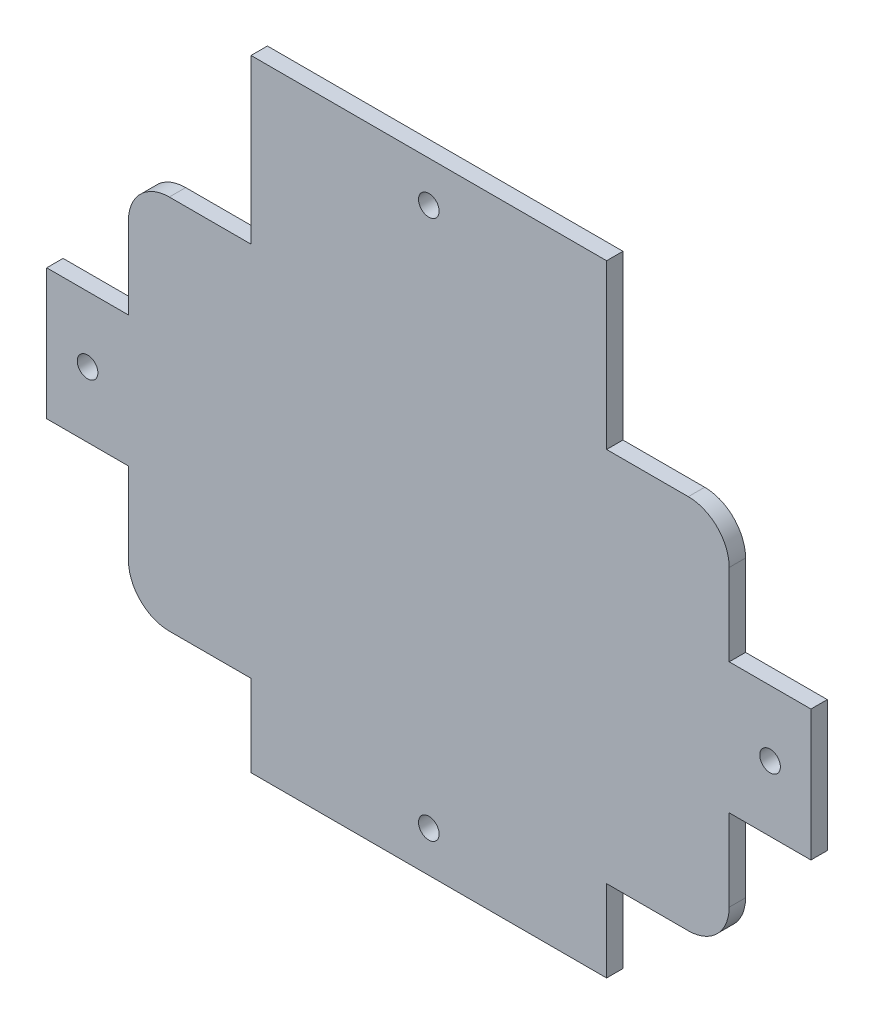
ISO-10303-21;
HEADER;
FILE_DESCRIPTION(('STEP AP214'),'2;1');
FILE_NAME('part.step','',(''),(''),'','','');
FILE_SCHEMA(('AUTOMOTIVE_DESIGN { 1 0 10303 214 1 1 1 1 }'));
ENDSEC;
DATA;
#1=APPLICATION_CONTEXT('core data for automotive mechanical design processes');
#2=APPLICATION_PROTOCOL_DEFINITION('international standard','automotive_design',2000,#1);
#3=PRODUCT_CONTEXT('',#1,'mechanical');
#4=PRODUCT('Part','Part','',(#3));
#5=PRODUCT_RELATED_PRODUCT_CATEGORY('part','',(#4));
#6=PRODUCT_DEFINITION_FORMATION('','',#4);
#7=PRODUCT_DEFINITION_CONTEXT('part definition',#1,'design');
#8=PRODUCT_DEFINITION('design','',#6,#7);
#9=PRODUCT_DEFINITION_SHAPE('','',#8);
#10=(LENGTH_UNIT() NAMED_UNIT(*) SI_UNIT(.MILLI.,.METRE.));
#11=(NAMED_UNIT(*) PLANE_ANGLE_UNIT() SI_UNIT($,.RADIAN.));
#12=(NAMED_UNIT(*) SI_UNIT($,.STERADIAN.) SOLID_ANGLE_UNIT());
#13=UNCERTAINTY_MEASURE_WITH_UNIT(LENGTH_MEASURE(1.E-05),#10,'distance_accuracy_value','');
#14=(GEOMETRIC_REPRESENTATION_CONTEXT(3) GLOBAL_UNCERTAINTY_ASSIGNED_CONTEXT((#13)) GLOBAL_UNIT_ASSIGNED_CONTEXT((#10,
#11,#12)) REPRESENTATION_CONTEXT('',''));
#15=CARTESIAN_POINT('',(0.,0.,0.));
#16=DIRECTION('',(0.,0.,1.));
#17=DIRECTION('',(1.,0.,0.));
#18=AXIS2_PLACEMENT_3D('',#15,#16,#17);
#19=CARTESIAN_POINT('',(-63.4999999999935,-35.9999999999968,4.));
#20=DIRECTION('',(0.,0.,1.));
#21=DIRECTION('',(1.,0.,0.));
#22=AXIS2_PLACEMENT_3D('',#19,#20,#21);
#23=PLANE('',#22);
#24=CARTESIAN_POINT('',(83.4999999999908,0.,4.));
#25=DIRECTION('',(0.,0.,1.));
#26=DIRECTION('',(1.,0.,0.));
#27=AXIS2_PLACEMENT_3D('',#24,#25,#26);
#28=CIRCLE('',#27,2.52499999999999);
#29=CARTESIAN_POINT('',(86.0249999999908,0.,4.));
#30=VERTEX_POINT('',#29);
#31=EDGE_CURVE('E449',#30,#30,#28,.T.);
#32=ORIENTED_EDGE('',*,*,#31,.F.);
#33=EDGE_LOOP('',(#32));
#34=FACE_BOUND('',#33,.T.);
#35=CARTESIAN_POINT('',(0.,75.9999999999968,4.));
#36=DIRECTION('',(0.,0.,1.));
#37=DIRECTION('',(1.,0.,0.));
#38=AXIS2_PLACEMENT_3D('',#35,#36,#37);
#39=CIRCLE('',#38,2.525);
#40=CARTESIAN_POINT('',(2.525,75.9999999999968,4.));
#41=VERTEX_POINT('',#40);
#42=EDGE_CURVE('E232',#41,#41,#39,.T.);
#43=ORIENTED_EDGE('',*,*,#42,.F.);
#44=EDGE_LOOP('',(#43));
#45=FACE_BOUND('',#44,.T.);
#46=DIRECTION('',(1.,0.,0.));
#47=VECTOR('',#46,1.);
#48=CARTESIAN_POINT('',(-93.4999999999908,-15.9999999999968,4.));
#49=LINE('',#48,#47);
#50=CARTESIAN_POINT('',(-93.4999999999908,-15.9999999999968,4.));
#51=VERTEX_POINT('',#50);
#52=CARTESIAN_POINT('',(-73.4999999999935,-15.9999999999968,4.));
#53=VERTEX_POINT('',#52);
#54=EDGE_CURVE('E275',#51,#53,#49,.T.);
#55=ORIENTED_EDGE('',*,*,#54,.T.);
#56=DIRECTION('',(0.,-1.,0.));
#57=VECTOR('',#56,1.);
#58=CARTESIAN_POINT('',(-73.4999999999935,-15.9999999999968,4.));
#59=LINE('',#58,#57);
#60=CARTESIAN_POINT('',(-73.4999999999935,-35.9999999999968,4.));
#61=VERTEX_POINT('',#60);
#62=EDGE_CURVE('E143',#53,#61,#59,.T.);
#63=ORIENTED_EDGE('',*,*,#62,.T.);
#64=CARTESIAN_POINT('',(-63.4999999999935,-35.9999999999968,4.));
#65=DIRECTION('',(0.,0.,1.));
#66=DIRECTION('',(1.,0.,0.));
#67=AXIS2_PLACEMENT_3D('',#64,#65,#66);
#68=CIRCLE('',#67,9.99999999999999);
#69=CARTESIAN_POINT('',(-63.4999999999935,-45.9999999999968,4.));
#70=VERTEX_POINT('',#69);
#71=EDGE_CURVE('E338',#61,#70,#68,.T.);
#72=ORIENTED_EDGE('',*,*,#71,.T.);
#73=DIRECTION('',(1.,0.,0.));
#74=VECTOR('',#73,1.);
#75=CARTESIAN_POINT('',(-63.4999999999935,-45.9999999999968,4.));
#76=LINE('',#75,#74);
#77=CARTESIAN_POINT('',(-43.5000000000011,-45.9999999999968,4.));
#78=VERTEX_POINT('',#77);
#79=EDGE_CURVE('E357',#70,#78,#76,.T.);
#80=ORIENTED_EDGE('',*,*,#79,.T.);
#81=DIRECTION('',(0.,-1.,0.));
#82=VECTOR('',#81,1.);
#83=CARTESIAN_POINT('',(-43.5000000000011,-45.9999999999968,4.));
#84=LINE('',#83,#82);
#85=CARTESIAN_POINT('',(-43.5000000000011,-65.9999999999967,4.));
#86=VERTEX_POINT('',#85);
#87=EDGE_CURVE('E354',#78,#86,#84,.T.);
#88=ORIENTED_EDGE('',*,*,#87,.T.);
#89=DIRECTION('',(1.,0.,0.));
#90=VECTOR('',#89,1.);
#91=CARTESIAN_POINT('',(-43.5000000000011,-65.9999999999967,4.));
#92=LINE('',#91,#90);
#93=CARTESIAN_POINT('',(43.5000000000011,-65.9999999999967,4.));
#94=VERTEX_POINT('',#93);
#95=EDGE_CURVE('E356',#86,#94,#92,.T.);
#96=ORIENTED_EDGE('',*,*,#95,.T.);
#97=DIRECTION('',(0.,1.,0.));
#98=VECTOR('',#97,1.);
#99=CARTESIAN_POINT('',(43.5000000000011,-65.9999999999967,4.));
#100=LINE('',#99,#98);
#101=CARTESIAN_POINT('',(43.5000000000011,-45.9999999999968,4.));
#102=VERTEX_POINT('',#101);
#103=EDGE_CURVE('E359',#94,#102,#100,.T.);
#104=ORIENTED_EDGE('',*,*,#103,.T.);
#105=DIRECTION('',(1.,0.,0.));
#106=VECTOR('',#105,1.);
#107=CARTESIAN_POINT('',(43.5000000000011,-45.9999999999968,4.));
#108=LINE('',#107,#106);
#109=CARTESIAN_POINT('',(63.4999999999935,-45.9999999999968,4.));
#110=VERTEX_POINT('',#109);
#111=EDGE_CURVE('E365',#102,#110,#108,.T.);
#112=ORIENTED_EDGE('',*,*,#111,.T.);
#113=CARTESIAN_POINT('',(63.4999999999935,-35.9999999999968,4.));
#114=DIRECTION('',(0.,0.,1.));
#115=DIRECTION('',(1.,0.,0.));
#116=AXIS2_PLACEMENT_3D('',#113,#114,#115);
#117=CIRCLE('',#116,9.99999999999999);
#118=CARTESIAN_POINT('',(73.4999999999935,-35.9999999999968,4.));
#119=VERTEX_POINT('',#118);
#120=EDGE_CURVE('E367',#110,#119,#117,.T.);
#121=ORIENTED_EDGE('',*,*,#120,.T.);
#122=DIRECTION('',(0.,1.,0.));
#123=VECTOR('',#122,1.);
#124=CARTESIAN_POINT('',(73.4999999999935,-35.9999999999968,4.));
#125=LINE('',#124,#123);
#126=CARTESIAN_POINT('',(73.4999999999935,-15.9999999999968,4.));
#127=VERTEX_POINT('',#126);
#128=EDGE_CURVE('E369',#119,#127,#125,.T.);
#129=ORIENTED_EDGE('',*,*,#128,.T.);
#130=DIRECTION('',(1.,0.,0.));
#131=VECTOR('',#130,1.);
#132=CARTESIAN_POINT('',(73.4999999999935,-15.9999999999968,4.));
#133=LINE('',#132,#131);
#134=CARTESIAN_POINT('',(93.4999999999908,-15.9999999999968,4.));
#135=VERTEX_POINT('',#134);
#136=EDGE_CURVE('E371',#127,#135,#133,.T.);
#137=ORIENTED_EDGE('',*,*,#136,.T.);
#138=DIRECTION('',(0.,1.,0.));
#139=VECTOR('',#138,1.);
#140=CARTESIAN_POINT('',(93.4999999999908,-15.9999999999968,4.));
#141=LINE('',#140,#139);
#142=CARTESIAN_POINT('',(93.499999999991,15.9999999999968,4.));
#143=VERTEX_POINT('',#142);
#144=EDGE_CURVE('E373',#135,#143,#141,.T.);
#145=ORIENTED_EDGE('',*,*,#144,.T.);
#146=DIRECTION('',(-1.,0.,0.));
#147=VECTOR('',#146,1.);
#148=CARTESIAN_POINT('',(93.499999999991,15.9999999999968,4.));
#149=LINE('',#148,#147);
#150=CARTESIAN_POINT('',(73.4999999999935,15.9999999999968,4.));
#151=VERTEX_POINT('',#150);
#152=EDGE_CURVE('E375',#143,#151,#149,.T.);
#153=ORIENTED_EDGE('',*,*,#152,.T.);
#154=DIRECTION('',(0.,1.,0.));
#155=VECTOR('',#154,1.);
#156=CARTESIAN_POINT('',(73.4999999999935,15.9999999999968,4.));
#157=LINE('',#156,#155);
#158=CARTESIAN_POINT('',(73.4999999999935,35.9999999999968,4.));
#159=VERTEX_POINT('',#158);
#160=EDGE_CURVE('E377',#151,#159,#157,.T.);
#161=ORIENTED_EDGE('',*,*,#160,.T.);
#162=CARTESIAN_POINT('',(63.4999999999935,35.9999999999968,4.));
#163=DIRECTION('',(0.,0.,1.));
#164=DIRECTION('',(1.,0.,0.));
#165=AXIS2_PLACEMENT_3D('',#162,#163,#164);
#166=CIRCLE('',#165,9.99999999999999);
#167=CARTESIAN_POINT('',(63.4999999999935,45.9999999999968,4.));
#168=VERTEX_POINT('',#167);
#169=EDGE_CURVE('E379',#159,#168,#166,.T.);
#170=ORIENTED_EDGE('',*,*,#169,.T.);
#171=DIRECTION('',(-1.,0.,0.));
#172=VECTOR('',#171,1.);
#173=CARTESIAN_POINT('',(63.4999999999935,45.9999999999968,4.));
#174=LINE('',#173,#172);
#175=CARTESIAN_POINT('',(43.5000000000011,45.9999999999968,4.));
#176=VERTEX_POINT('',#175);
#177=EDGE_CURVE('E381',#168,#176,#174,.T.);
#178=ORIENTED_EDGE('',*,*,#177,.T.);
#179=DIRECTION('',(0.,1.,0.));
#180=VECTOR('',#179,1.);
#181=CARTESIAN_POINT('',(43.5000000000011,45.9999999999968,4.));
#182=LINE('',#181,#180);
#183=CARTESIAN_POINT('',(43.5000000000011,85.9999999999968,4.));
#184=VERTEX_POINT('',#183);
#185=EDGE_CURVE('E383',#176,#184,#182,.T.);
#186=ORIENTED_EDGE('',*,*,#185,.T.);
#187=DIRECTION('',(-1.,0.,0.));
#188=VECTOR('',#187,1.);
#189=CARTESIAN_POINT('',(43.5000000000011,85.9999999999968,4.));
#190=LINE('',#189,#188);
#191=CARTESIAN_POINT('',(-43.5000000000011,85.9999999999968,4.));
#192=VERTEX_POINT('',#191);
#193=EDGE_CURVE('E385',#184,#192,#190,.T.);
#194=ORIENTED_EDGE('',*,*,#193,.T.);
#195=DIRECTION('',(0.,-1.,0.));
#196=VECTOR('',#195,1.);
#197=CARTESIAN_POINT('',(-43.5000000000011,85.9999999999968,4.));
#198=LINE('',#197,#196);
#199=CARTESIAN_POINT('',(-43.5000000000011,45.9999999999968,4.));
#200=VERTEX_POINT('',#199);
#201=EDGE_CURVE('E387',#192,#200,#198,.T.);
#202=ORIENTED_EDGE('',*,*,#201,.T.);
#203=DIRECTION('',(-1.,0.,0.));
#204=VECTOR('',#203,1.);
#205=CARTESIAN_POINT('',(-43.5000000000011,45.9999999999968,4.));
#206=LINE('',#205,#204);
#207=CARTESIAN_POINT('',(-63.4999999999935,45.9999999999968,4.));
#208=VERTEX_POINT('',#207);
#209=EDGE_CURVE('E389',#200,#208,#206,.T.);
#210=ORIENTED_EDGE('',*,*,#209,.T.);
#211=CARTESIAN_POINT('',(-63.4999999999935,35.9999999999968,4.));
#212=DIRECTION('',(0.,0.,1.));
#213=DIRECTION('',(1.,0.,0.));
#214=AXIS2_PLACEMENT_3D('',#211,#212,#213);
#215=CIRCLE('',#214,9.99999999999999);
#216=CARTESIAN_POINT('',(-73.4999999999935,35.9999999999968,4.));
#217=VERTEX_POINT('',#216);
#218=EDGE_CURVE('E210',#208,#217,#215,.T.);
#219=ORIENTED_EDGE('',*,*,#218,.T.);
#220=DIRECTION('',(0.,-1.,0.));
#221=VECTOR('',#220,1.);
#222=CARTESIAN_POINT('',(-73.4999999999935,35.9999999999968,4.));
#223=LINE('',#222,#221);
#224=CARTESIAN_POINT('',(-73.4999999999935,15.9999999999968,4.));
#225=VERTEX_POINT('',#224);
#226=EDGE_CURVE('E204',#217,#225,#223,.T.);
#227=ORIENTED_EDGE('',*,*,#226,.T.);
#228=DIRECTION('',(-1.,0.,0.));
#229=VECTOR('',#228,1.);
#230=CARTESIAN_POINT('',(-73.4999999999935,15.9999999999968,4.));
#231=LINE('',#230,#229);
#232=CARTESIAN_POINT('',(-93.499999999991,15.9999999999968,4.));
#233=VERTEX_POINT('',#232);
#234=EDGE_CURVE('E208',#225,#233,#231,.T.);
#235=ORIENTED_EDGE('',*,*,#234,.T.);
#236=DIRECTION('',(0.,-1.,0.));
#237=VECTOR('',#236,1.);
#238=CARTESIAN_POINT('',(-93.499999999991,15.9999999999968,4.));
#239=LINE('',#238,#237);
#240=EDGE_CURVE('E52',#233,#51,#239,.T.);
#241=ORIENTED_EDGE('',*,*,#240,.T.);
#242=EDGE_LOOP('',(#55,#63,#72,#80,#88,#96,#104,#112,#121,#129,#137,#145,#153,#161,#170,#178,
#186,#194,#202,#210,#219,#227,#235,#241));
#243=FACE_BOUND('',#242,.T.);
#244=CARTESIAN_POINT('',(-83.4999999999908,0.,4.));
#245=DIRECTION('',(0.,0.,1.));
#246=DIRECTION('',(1.,0.,0.));
#247=AXIS2_PLACEMENT_3D('',#244,#245,#246);
#248=CIRCLE('',#247,2.52499999999999);
#249=CARTESIAN_POINT('',(-80.9749999999908,0.,4.));
#250=VERTEX_POINT('',#249);
#251=EDGE_CURVE('E455',#250,#250,#248,.T.);
#252=ORIENTED_EDGE('',*,*,#251,.F.);
#253=EDGE_LOOP('',(#252));
#254=FACE_BOUND('',#253,.T.);
#255=CARTESIAN_POINT('',(0.,-55.9999999999967,4.));
#256=DIRECTION('',(0.,0.,1.));
#257=DIRECTION('',(1.,0.,0.));
#258=AXIS2_PLACEMENT_3D('',#255,#256,#257);
#259=CIRCLE('',#258,2.525);
#260=CARTESIAN_POINT('',(2.525,-55.9999999999967,4.));
#261=VERTEX_POINT('',#260);
#262=EDGE_CURVE('E440',#261,#261,#259,.T.);
#263=ORIENTED_EDGE('',*,*,#262,.F.);
#264=EDGE_LOOP('',(#263));
#265=FACE_BOUND('',#264,.T.);
#266=ADVANCED_FACE('F35',(#34,#45,#243,#254,#265),#23,.T.);
#267=CARTESIAN_POINT('',(-63.4999999999935,-35.9999999999968,0.));
#268=DIRECTION('',(0.,0.,1.));
#269=DIRECTION('',(1.,0.,0.));
#270=AXIS2_PLACEMENT_3D('',#267,#268,#269);
#271=PLANE('',#270);
#272=DIRECTION('',(1.,0.,0.));
#273=VECTOR('',#272,1.);
#274=CARTESIAN_POINT('',(-93.4999999999908,-15.9999999999968,0.));
#275=LINE('',#274,#273);
#276=CARTESIAN_POINT('',(-93.4999999999908,-15.9999999999968,0.));
#277=VERTEX_POINT('',#276);
#278=CARTESIAN_POINT('',(-73.4999999999935,-15.9999999999968,0.));
#279=VERTEX_POINT('',#278);
#280=EDGE_CURVE('E228',#277,#279,#275,.T.);
#281=ORIENTED_EDGE('',*,*,#280,.F.);
#282=DIRECTION('',(0.,-1.,0.));
#283=VECTOR('',#282,1.);
#284=CARTESIAN_POINT('',(-93.499999999991,15.9999999999968,0.));
#285=LINE('',#284,#283);
#286=CARTESIAN_POINT('',(-93.499999999991,15.9999999999968,0.));
#287=VERTEX_POINT('',#286);
#288=EDGE_CURVE('E135',#287,#277,#285,.T.);
#289=ORIENTED_EDGE('',*,*,#288,.F.);
#290=DIRECTION('',(-1.,0.,0.));
#291=VECTOR('',#290,1.);
#292=CARTESIAN_POINT('',(-73.4999999999935,15.9999999999968,0.));
#293=LINE('',#292,#291);
#294=CARTESIAN_POINT('',(-73.4999999999935,15.9999999999968,0.));
#295=VERTEX_POINT('',#294);
#296=EDGE_CURVE('E129',#295,#287,#293,.T.);
#297=ORIENTED_EDGE('',*,*,#296,.F.);
#298=DIRECTION('',(0.,-1.,0.));
#299=VECTOR('',#298,1.);
#300=CARTESIAN_POINT('',(-73.4999999999935,35.9999999999968,0.));
#301=LINE('',#300,#299);
#302=CARTESIAN_POINT('',(-73.4999999999935,35.9999999999968,0.));
#303=VERTEX_POINT('',#302);
#304=EDGE_CURVE('E218',#303,#295,#301,.T.);
#305=ORIENTED_EDGE('',*,*,#304,.F.);
#306=CARTESIAN_POINT('',(-63.4999999999935,35.9999999999968,0.));
#307=DIRECTION('',(0.,0.,1.));
#308=DIRECTION('',(1.,0.,0.));
#309=AXIS2_PLACEMENT_3D('',#306,#307,#308);
#310=CIRCLE('',#309,9.99999999999999);
#311=CARTESIAN_POINT('',(-63.4999999999935,45.9999999999968,0.));
#312=VERTEX_POINT('',#311);
#313=EDGE_CURVE('E270',#312,#303,#310,.T.);
#314=ORIENTED_EDGE('',*,*,#313,.F.);
#315=DIRECTION('',(-1.,0.,0.));
#316=VECTOR('',#315,1.);
#317=CARTESIAN_POINT('',(-43.5000000000011,45.9999999999968,0.));
#318=LINE('',#317,#316);
#319=CARTESIAN_POINT('',(-43.5000000000011,45.9999999999968,0.));
#320=VERTEX_POINT('',#319);
#321=EDGE_CURVE('E268',#320,#312,#318,.T.);
#322=ORIENTED_EDGE('',*,*,#321,.F.);
#323=DIRECTION('',(0.,-1.,0.));
#324=VECTOR('',#323,1.);
#325=CARTESIAN_POINT('',(-43.5000000000011,85.9999999999968,0.));
#326=LINE('',#325,#324);
#327=CARTESIAN_POINT('',(-43.5000000000011,85.9999999999968,0.));
#328=VERTEX_POINT('',#327);
#329=EDGE_CURVE('E266',#328,#320,#326,.T.);
#330=ORIENTED_EDGE('',*,*,#329,.F.);
#331=DIRECTION('',(-1.,0.,0.));
#332=VECTOR('',#331,1.);
#333=CARTESIAN_POINT('',(43.5000000000011,85.9999999999968,0.));
#334=LINE('',#333,#332);
#335=CARTESIAN_POINT('',(43.5000000000011,85.9999999999968,0.));
#336=VERTEX_POINT('',#335);
#337=EDGE_CURVE('E264',#336,#328,#334,.T.);
#338=ORIENTED_EDGE('',*,*,#337,.F.);
#339=DIRECTION('',(0.,1.,0.));
#340=VECTOR('',#339,1.);
#341=CARTESIAN_POINT('',(43.5000000000011,45.9999999999968,0.));
#342=LINE('',#341,#340);
#343=CARTESIAN_POINT('',(43.5000000000011,45.9999999999968,0.));
#344=VERTEX_POINT('',#343);
#345=EDGE_CURVE('E262',#344,#336,#342,.T.);
#346=ORIENTED_EDGE('',*,*,#345,.F.);
#347=DIRECTION('',(-1.,0.,0.));
#348=VECTOR('',#347,1.);
#349=CARTESIAN_POINT('',(63.4999999999935,45.9999999999968,0.));
#350=LINE('',#349,#348);
#351=CARTESIAN_POINT('',(63.4999999999935,45.9999999999968,0.));
#352=VERTEX_POINT('',#351);
#353=EDGE_CURVE('E260',#352,#344,#350,.T.);
#354=ORIENTED_EDGE('',*,*,#353,.F.);
#355=CARTESIAN_POINT('',(63.4999999999935,35.9999999999968,0.));
#356=DIRECTION('',(0.,0.,1.));
#357=DIRECTION('',(1.,0.,0.));
#358=AXIS2_PLACEMENT_3D('',#355,#356,#357);
#359=CIRCLE('',#358,9.99999999999999);
#360=CARTESIAN_POINT('',(73.4999999999935,35.9999999999968,0.));
#361=VERTEX_POINT('',#360);
#362=EDGE_CURVE('E258',#361,#352,#359,.T.);
#363=ORIENTED_EDGE('',*,*,#362,.F.);
#364=DIRECTION('',(0.,1.,0.));
#365=VECTOR('',#364,1.);
#366=CARTESIAN_POINT('',(73.4999999999935,15.9999999999968,0.));
#367=LINE('',#366,#365);
#368=CARTESIAN_POINT('',(73.4999999999935,15.9999999999968,0.));
#369=VERTEX_POINT('',#368);
#370=EDGE_CURVE('E256',#369,#361,#367,.T.);
#371=ORIENTED_EDGE('',*,*,#370,.F.);
#372=DIRECTION('',(-1.,0.,0.));
#373=VECTOR('',#372,1.);
#374=CARTESIAN_POINT('',(93.499999999991,15.9999999999968,0.));
#375=LINE('',#374,#373);
#376=CARTESIAN_POINT('',(93.499999999991,15.9999999999968,0.));
#377=VERTEX_POINT('',#376);
#378=EDGE_CURVE('E254',#377,#369,#375,.T.);
#379=ORIENTED_EDGE('',*,*,#378,.F.);
#380=DIRECTION('',(0.,1.,0.));
#381=VECTOR('',#380,1.);
#382=CARTESIAN_POINT('',(93.4999999999908,-15.9999999999968,0.));
#383=LINE('',#382,#381);
#384=CARTESIAN_POINT('',(93.4999999999908,-15.9999999999968,0.));
#385=VERTEX_POINT('',#384);
#386=EDGE_CURVE('E252',#385,#377,#383,.T.);
#387=ORIENTED_EDGE('',*,*,#386,.F.);
#388=DIRECTION('',(1.,0.,0.));
#389=VECTOR('',#388,1.);
#390=CARTESIAN_POINT('',(73.4999999999935,-15.9999999999968,0.));
#391=LINE('',#390,#389);
#392=CARTESIAN_POINT('',(73.4999999999935,-15.9999999999968,0.));
#393=VERTEX_POINT('',#392);
#394=EDGE_CURVE('E250',#393,#385,#391,.T.);
#395=ORIENTED_EDGE('',*,*,#394,.F.);
#396=DIRECTION('',(0.,1.,0.));
#397=VECTOR('',#396,1.);
#398=CARTESIAN_POINT('',(73.4999999999935,-35.9999999999968,0.));
#399=LINE('',#398,#397);
#400=CARTESIAN_POINT('',(73.4999999999935,-35.9999999999968,0.));
#401=VERTEX_POINT('',#400);
#402=EDGE_CURVE('E248',#401,#393,#399,.T.);
#403=ORIENTED_EDGE('',*,*,#402,.F.);
#404=CARTESIAN_POINT('',(63.4999999999935,-35.9999999999968,0.));
#405=DIRECTION('',(0.,0.,1.));
#406=DIRECTION('',(1.,0.,0.));
#407=AXIS2_PLACEMENT_3D('',#404,#405,#406);
#408=CIRCLE('',#407,9.99999999999999);
#409=CARTESIAN_POINT('',(63.4999999999935,-45.9999999999968,0.));
#410=VERTEX_POINT('',#409);
#411=EDGE_CURVE('E246',#410,#401,#408,.T.);
#412=ORIENTED_EDGE('',*,*,#411,.F.);
#413=DIRECTION('',(1.,0.,0.));
#414=VECTOR('',#413,1.);
#415=CARTESIAN_POINT('',(43.5000000000011,-45.9999999999968,0.));
#416=LINE('',#415,#414);
#417=CARTESIAN_POINT('',(43.5000000000011,-45.9999999999968,0.));
#418=VERTEX_POINT('',#417);
#419=EDGE_CURVE('E244',#418,#410,#416,.T.);
#420=ORIENTED_EDGE('',*,*,#419,.F.);
#421=DIRECTION('',(0.,1.,0.));
#422=VECTOR('',#421,1.);
#423=CARTESIAN_POINT('',(43.5000000000011,-65.9999999999967,0.));
#424=LINE('',#423,#422);
#425=CARTESIAN_POINT('',(43.5000000000011,-65.9999999999967,0.));
#426=VERTEX_POINT('',#425);
#427=EDGE_CURVE('E242',#426,#418,#424,.T.);
#428=ORIENTED_EDGE('',*,*,#427,.F.);
#429=DIRECTION('',(1.,0.,0.));
#430=VECTOR('',#429,1.);
#431=CARTESIAN_POINT('',(-43.5000000000011,-65.9999999999967,0.));
#432=LINE('',#431,#430);
#433=CARTESIAN_POINT('',(-43.5000000000011,-65.9999999999967,0.));
#434=VERTEX_POINT('',#433);
#435=EDGE_CURVE('E240',#434,#426,#432,.T.);
#436=ORIENTED_EDGE('',*,*,#435,.F.);
#437=DIRECTION('',(0.,-1.,0.));
#438=VECTOR('',#437,1.);
#439=CARTESIAN_POINT('',(-43.5000000000011,-45.9999999999968,0.));
#440=LINE('',#439,#438);
#441=CARTESIAN_POINT('',(-43.5000000000011,-45.9999999999968,0.));
#442=VERTEX_POINT('',#441);
#443=EDGE_CURVE('E238',#442,#434,#440,.T.);
#444=ORIENTED_EDGE('',*,*,#443,.F.);
#445=DIRECTION('',(1.,0.,0.));
#446=VECTOR('',#445,1.);
#447=CARTESIAN_POINT('',(-63.4999999999935,-45.9999999999968,0.));
#448=LINE('',#447,#446);
#449=CARTESIAN_POINT('',(-63.4999999999935,-45.9999999999968,0.));
#450=VERTEX_POINT('',#449);
#451=EDGE_CURVE('E236',#450,#442,#448,.T.);
#452=ORIENTED_EDGE('',*,*,#451,.F.);
#453=CARTESIAN_POINT('',(-63.4999999999935,-35.9999999999968,0.));
#454=DIRECTION('',(0.,0.,1.));
#455=DIRECTION('',(1.,0.,0.));
#456=AXIS2_PLACEMENT_3D('',#453,#454,#455);
#457=CIRCLE('',#456,9.99999999999999);
#458=CARTESIAN_POINT('',(-73.4999999999935,-35.9999999999968,0.));
#459=VERTEX_POINT('',#458);
#460=EDGE_CURVE('E234',#459,#450,#457,.T.);
#461=ORIENTED_EDGE('',*,*,#460,.F.);
#462=DIRECTION('',(0.,-1.,0.));
#463=VECTOR('',#462,1.);
#464=CARTESIAN_POINT('',(-73.4999999999935,-15.9999999999968,0.));
#465=LINE('',#464,#463);
#466=EDGE_CURVE('E231',#279,#459,#465,.T.);
#467=ORIENTED_EDGE('',*,*,#466,.F.);
#468=EDGE_LOOP('',(#281,#289,#297,#305,#314,#322,#330,#338,#346,#354,#363,#371,#379,#387,#395,
#403,#412,#420,#428,#436,#444,#452,#461,#467));
#469=FACE_BOUND('',#468,.T.);
#470=CARTESIAN_POINT('',(0.,75.9999999999968,0.));
#471=DIRECTION('',(0.,0.,1.));
#472=DIRECTION('',(1.,0.,0.));
#473=AXIS2_PLACEMENT_3D('',#470,#471,#472);
#474=CIRCLE('',#473,2.525);
#475=CARTESIAN_POINT('',(2.525,75.9999999999968,0.));
#476=VERTEX_POINT('',#475);
#477=EDGE_CURVE('E458',#476,#476,#474,.T.);
#478=ORIENTED_EDGE('',*,*,#477,.T.);
#479=EDGE_LOOP('',(#478));
#480=FACE_BOUND('',#479,.T.);
#481=CARTESIAN_POINT('',(-83.4999999999908,0.,0.));
#482=DIRECTION('',(0.,0.,1.));
#483=DIRECTION('',(1.,0.,0.));
#484=AXIS2_PLACEMENT_3D('',#481,#482,#483);
#485=CIRCLE('',#484,2.52499999999999);
#486=CARTESIAN_POINT('',(-80.9749999999908,0.,0.));
#487=VERTEX_POINT('',#486);
#488=EDGE_CURVE('E452',#487,#487,#485,.T.);
#489=ORIENTED_EDGE('',*,*,#488,.T.);
#490=EDGE_LOOP('',(#489));
#491=FACE_BOUND('',#490,.T.);
#492=CARTESIAN_POINT('',(83.4999999999908,0.,0.));
#493=DIRECTION('',(0.,0.,1.));
#494=DIRECTION('',(1.,0.,0.));
#495=AXIS2_PLACEMENT_3D('',#492,#493,#494);
#496=CIRCLE('',#495,2.52499999999999);
#497=CARTESIAN_POINT('',(86.0249999999908,0.,0.));
#498=VERTEX_POINT('',#497);
#499=EDGE_CURVE('E446',#498,#498,#496,.T.);
#500=ORIENTED_EDGE('',*,*,#499,.T.);
#501=EDGE_LOOP('',(#500));
#502=FACE_BOUND('',#501,.T.);
#503=CARTESIAN_POINT('',(0.,-55.9999999999967,0.));
#504=DIRECTION('',(0.,0.,1.));
#505=DIRECTION('',(1.,0.,0.));
#506=AXIS2_PLACEMENT_3D('',#503,#504,#505);
#507=CIRCLE('',#506,2.525);
#508=CARTESIAN_POINT('',(2.525,-55.9999999999967,0.));
#509=VERTEX_POINT('',#508);
#510=EDGE_CURVE('E443',#509,#509,#507,.T.);
#511=ORIENTED_EDGE('',*,*,#510,.T.);
#512=EDGE_LOOP('',(#511));
#513=FACE_BOUND('',#512,.T.);
#514=ADVANCED_FACE('F342',(#469,#480,#491,#502,#513),#271,.F.);
#515=CARTESIAN_POINT('',(-93.4999999999908,-15.9999999999968,4.));
#516=DIRECTION('',(0.,1.,0.));
#517=DIRECTION('',(0.,0.,1.));
#518=AXIS2_PLACEMENT_3D('',#515,#516,#517);
#519=PLANE('',#518);
#520=ORIENTED_EDGE('',*,*,#280,.T.);
#521=DIRECTION('',(0.,0.,-1.));
#522=VECTOR('',#521,1.);
#523=CARTESIAN_POINT('',(-73.4999999999935,-15.9999999999968,4.));
#524=LINE('',#523,#522);
#525=EDGE_CURVE('E11',#53,#279,#524,.T.);
#526=ORIENTED_EDGE('',*,*,#525,.F.);
#527=ORIENTED_EDGE('',*,*,#54,.F.);
#528=DIRECTION('',(0.,0.,-1.));
#529=VECTOR('',#528,1.);
#530=CARTESIAN_POINT('',(-93.4999999999908,-15.9999999999968,4.));
#531=LINE('',#530,#529);
#532=EDGE_CURVE('E224',#51,#277,#531,.T.);
#533=ORIENTED_EDGE('',*,*,#532,.T.);
#534=EDGE_LOOP('',(#520,#526,#527,#533));
#535=FACE_BOUND('',#534,.T.);
#536=ADVANCED_FACE('F37',(#535),#519,.F.);
#537=CARTESIAN_POINT('',(-73.4999999999935,-15.9999999999968,4.));
#538=DIRECTION('',(1.,0.,0.));
#539=DIRECTION('',(0.,0.,-1.));
#540=AXIS2_PLACEMENT_3D('',#537,#538,#539);
#541=PLANE('',#540);
#542=ORIENTED_EDGE('',*,*,#466,.T.);
#543=DIRECTION('',(0.,0.,-1.));
#544=VECTOR('',#543,1.);
#545=CARTESIAN_POINT('',(-73.4999999999935,-35.9999999999968,4.));
#546=LINE('',#545,#544);
#547=EDGE_CURVE('E44',#61,#459,#546,.T.);
#548=ORIENTED_EDGE('',*,*,#547,.F.);
#549=ORIENTED_EDGE('',*,*,#62,.F.);
#550=ORIENTED_EDGE('',*,*,#525,.T.);
#551=EDGE_LOOP('',(#542,#548,#549,#550));
#552=FACE_BOUND('',#551,.T.);
#553=ADVANCED_FACE('F688',(#552),#541,.F.);
#554=CARTESIAN_POINT('',(-63.4999999999935,-35.9999999999968,4.));
#555=DIRECTION('',(0.,0.,-1.));
#556=DIRECTION('',(-1.,0.,0.));
#557=AXIS2_PLACEMENT_3D('',#554,#555,#556);
#558=CYLINDRICAL_SURFACE('',#557,9.99999999999999);
#559=ORIENTED_EDGE('',*,*,#460,.T.);
#560=DIRECTION('',(0.,0.,-1.));
#561=VECTOR('',#560,1.);
#562=CARTESIAN_POINT('',(-63.4999999999935,-45.9999999999968,4.));
#563=LINE('',#562,#561);
#564=EDGE_CURVE('E330',#70,#450,#563,.T.);
#565=ORIENTED_EDGE('',*,*,#564,.F.);
#566=ORIENTED_EDGE('',*,*,#71,.F.);
#567=ORIENTED_EDGE('',*,*,#547,.T.);
#568=EDGE_LOOP('',(#559,#565,#566,#567));
#569=FACE_BOUND('',#568,.T.);
#570=ADVANCED_FACE('F336',(#569),#558,.T.);
#571=CARTESIAN_POINT('',(-63.4999999999935,-45.9999999999968,4.));
#572=DIRECTION('',(0.,1.,0.));
#573=DIRECTION('',(-1.,0.,0.));
#574=AXIS2_PLACEMENT_3D('',#571,#572,#573);
#575=PLANE('',#574);
#576=ORIENTED_EDGE('',*,*,#451,.T.);
#577=DIRECTION('',(0.,0.,-1.));
#578=VECTOR('',#577,1.);
#579=CARTESIAN_POINT('',(-43.5000000000011,-45.9999999999968,4.));
#580=LINE('',#579,#578);
#581=EDGE_CURVE('E327',#78,#442,#580,.T.);
#582=ORIENTED_EDGE('',*,*,#581,.F.);
#583=ORIENTED_EDGE('',*,*,#79,.F.);
#584=ORIENTED_EDGE('',*,*,#564,.T.);
#585=EDGE_LOOP('',(#576,#582,#583,#584));
#586=FACE_BOUND('',#585,.T.);
#587=ADVANCED_FACE('F348',(#586),#575,.F.);
#588=CARTESIAN_POINT('',(-43.5000000000011,-45.9999999999968,4.));
#589=DIRECTION('',(1.,0.,0.));
#590=DIRECTION('',(0.,0.,-1.));
#591=AXIS2_PLACEMENT_3D('',#588,#589,#590);
#592=PLANE('',#591);
#593=ORIENTED_EDGE('',*,*,#443,.T.);
#594=DIRECTION('',(0.,0.,-1.));
#595=VECTOR('',#594,1.);
#596=CARTESIAN_POINT('',(-43.5000000000011,-65.9999999999967,4.));
#597=LINE('',#596,#595);
#598=EDGE_CURVE('E324',#86,#434,#597,.T.);
#599=ORIENTED_EDGE('',*,*,#598,.F.);
#600=ORIENTED_EDGE('',*,*,#87,.F.);
#601=ORIENTED_EDGE('',*,*,#581,.T.);
#602=EDGE_LOOP('',(#593,#599,#600,#601));
#603=FACE_BOUND('',#602,.T.);
#604=ADVANCED_FACE('F352',(#603),#592,.F.);
#605=CARTESIAN_POINT('',(-43.5000000000011,-65.9999999999967,4.));
#606=DIRECTION('',(0.,1.,0.));
#607=DIRECTION('',(0.,0.,1.));
#608=AXIS2_PLACEMENT_3D('',#605,#606,#607);
#609=PLANE('',#608);
#610=ORIENTED_EDGE('',*,*,#435,.T.);
#611=DIRECTION('',(0.,0.,-1.));
#612=VECTOR('',#611,1.);
#613=CARTESIAN_POINT('',(43.5000000000011,-65.9999999999967,4.));
#614=LINE('',#613,#612);
#615=EDGE_CURVE('E321',#94,#426,#614,.T.);
#616=ORIENTED_EDGE('',*,*,#615,.F.);
#617=ORIENTED_EDGE('',*,*,#95,.F.);
#618=ORIENTED_EDGE('',*,*,#598,.T.);
#619=EDGE_LOOP('',(#610,#616,#617,#618));
#620=FACE_BOUND('',#619,.T.);
#621=ADVANCED_FACE('F653',(#620),#609,.F.);
#622=CARTESIAN_POINT('',(43.5000000000011,-65.9999999999967,4.));
#623=DIRECTION('',(-1.,0.,0.));
#624=DIRECTION('',(0.,0.,1.));
#625=AXIS2_PLACEMENT_3D('',#622,#623,#624);
#626=PLANE('',#625);
#627=ORIENTED_EDGE('',*,*,#427,.T.);
#628=DIRECTION('',(0.,0.,-1.));
#629=VECTOR('',#628,1.);
#630=CARTESIAN_POINT('',(43.5000000000011,-45.9999999999968,4.));
#631=LINE('',#630,#629);
#632=EDGE_CURVE('E318',#102,#418,#631,.T.);
#633=ORIENTED_EDGE('',*,*,#632,.F.);
#634=ORIENTED_EDGE('',*,*,#103,.F.);
#635=ORIENTED_EDGE('',*,*,#615,.T.);
#636=EDGE_LOOP('',(#627,#633,#634,#635));
#637=FACE_BOUND('',#636,.T.);
#638=ADVANCED_FACE('F643',(#637),#626,.F.);
#639=CARTESIAN_POINT('',(43.5000000000011,-45.9999999999968,4.));
#640=DIRECTION('',(0.,1.,0.));
#641=DIRECTION('',(-1.,0.,0.));
#642=AXIS2_PLACEMENT_3D('',#639,#640,#641);
#643=PLANE('',#642);
#644=ORIENTED_EDGE('',*,*,#419,.T.);
#645=DIRECTION('',(0.,0.,-1.));
#646=VECTOR('',#645,1.);
#647=CARTESIAN_POINT('',(63.4999999999935,-45.9999999999968,4.));
#648=LINE('',#647,#646);
#649=EDGE_CURVE('E315',#110,#410,#648,.T.);
#650=ORIENTED_EDGE('',*,*,#649,.F.);
#651=ORIENTED_EDGE('',*,*,#111,.F.);
#652=ORIENTED_EDGE('',*,*,#632,.T.);
#653=EDGE_LOOP('',(#644,#650,#651,#652));
#654=FACE_BOUND('',#653,.T.);
#655=ADVANCED_FACE('F633',(#654),#643,.F.);
#656=CARTESIAN_POINT('',(63.4999999999935,-35.9999999999968,4.));
#657=DIRECTION('',(0.,0.,-1.));
#658=DIRECTION('',(-1.,0.,0.));
#659=AXIS2_PLACEMENT_3D('',#656,#657,#658);
#660=CYLINDRICAL_SURFACE('',#659,9.99999999999999);
#661=ORIENTED_EDGE('',*,*,#411,.T.);
#662=DIRECTION('',(0.,0.,-1.));
#663=VECTOR('',#662,1.);
#664=CARTESIAN_POINT('',(73.4999999999935,-35.9999999999968,4.));
#665=LINE('',#664,#663);
#666=EDGE_CURVE('E312',#119,#401,#665,.T.);
#667=ORIENTED_EDGE('',*,*,#666,.F.);
#668=ORIENTED_EDGE('',*,*,#120,.F.);
#669=ORIENTED_EDGE('',*,*,#649,.T.);
#670=EDGE_LOOP('',(#661,#667,#668,#669));
#671=FACE_BOUND('',#670,.T.);
#672=ADVANCED_FACE('F623',(#671),#660,.T.);
#673=CARTESIAN_POINT('',(73.4999999999935,-35.9999999999968,4.));
#674=DIRECTION('',(-1.,0.,0.));
#675=DIRECTION('',(0.,0.,1.));
#676=AXIS2_PLACEMENT_3D('',#673,#674,#675);
#677=PLANE('',#676);
#678=ORIENTED_EDGE('',*,*,#402,.T.);
#679=DIRECTION('',(0.,0.,-1.));
#680=VECTOR('',#679,1.);
#681=CARTESIAN_POINT('',(73.4999999999935,-15.9999999999968,4.));
#682=LINE('',#681,#680);
#683=EDGE_CURVE('E309',#127,#393,#682,.T.);
#684=ORIENTED_EDGE('',*,*,#683,.F.);
#685=ORIENTED_EDGE('',*,*,#128,.F.);
#686=ORIENTED_EDGE('',*,*,#666,.T.);
#687=EDGE_LOOP('',(#678,#684,#685,#686));
#688=FACE_BOUND('',#687,.T.);
#689=ADVANCED_FACE('F613',(#688),#677,.F.);
#690=CARTESIAN_POINT('',(73.4999999999935,-15.9999999999968,4.));
#691=DIRECTION('',(0.,1.,0.));
#692=DIRECTION('',(0.,0.,1.));
#693=AXIS2_PLACEMENT_3D('',#690,#691,#692);
#694=PLANE('',#693);
#695=ORIENTED_EDGE('',*,*,#394,.T.);
#696=DIRECTION('',(0.,0.,-1.));
#697=VECTOR('',#696,1.);
#698=CARTESIAN_POINT('',(93.4999999999908,-15.9999999999968,4.));
#699=LINE('',#698,#697);
#700=EDGE_CURVE('E306',#135,#385,#699,.T.);
#701=ORIENTED_EDGE('',*,*,#700,.F.);
#702=ORIENTED_EDGE('',*,*,#136,.F.);
#703=ORIENTED_EDGE('',*,*,#683,.T.);
#704=EDGE_LOOP('',(#695,#701,#702,#703));
#705=FACE_BOUND('',#704,.T.);
#706=ADVANCED_FACE('F603',(#705),#694,.F.);
#707=CARTESIAN_POINT('',(93.4999999999908,-15.9999999999968,4.));
#708=DIRECTION('',(-1.,0.,0.));
#709=DIRECTION('',(0.,-1.,0.));
#710=AXIS2_PLACEMENT_3D('',#707,#708,#709);
#711=PLANE('',#710);
#712=ORIENTED_EDGE('',*,*,#386,.T.);
#713=DIRECTION('',(0.,0.,-1.));
#714=VECTOR('',#713,1.);
#715=CARTESIAN_POINT('',(93.499999999991,15.9999999999968,4.));
#716=LINE('',#715,#714);
#717=EDGE_CURVE('E303',#143,#377,#716,.T.);
#718=ORIENTED_EDGE('',*,*,#717,.F.);
#719=ORIENTED_EDGE('',*,*,#144,.F.);
#720=ORIENTED_EDGE('',*,*,#700,.T.);
#721=EDGE_LOOP('',(#712,#718,#719,#720));
#722=FACE_BOUND('',#721,.T.);
#723=ADVANCED_FACE('F593',(#722),#711,.F.);
#724=CARTESIAN_POINT('',(93.499999999991,15.9999999999968,4.));
#725=DIRECTION('',(0.,-1.,0.));
#726=DIRECTION('',(0.,0.,-1.));
#727=AXIS2_PLACEMENT_3D('',#724,#725,#726);
#728=PLANE('',#727);
#729=ORIENTED_EDGE('',*,*,#378,.T.);
#730=DIRECTION('',(0.,0.,-1.));
#731=VECTOR('',#730,1.);
#732=CARTESIAN_POINT('',(73.4999999999935,15.9999999999968,4.));
#733=LINE('',#732,#731);
#734=EDGE_CURVE('E300',#151,#369,#733,.T.);
#735=ORIENTED_EDGE('',*,*,#734,.F.);
#736=ORIENTED_EDGE('',*,*,#152,.F.);
#737=ORIENTED_EDGE('',*,*,#717,.T.);
#738=EDGE_LOOP('',(#729,#735,#736,#737));
#739=FACE_BOUND('',#738,.T.);
#740=ADVANCED_FACE('F583',(#739),#728,.F.);
#741=CARTESIAN_POINT('',(73.4999999999935,15.9999999999968,4.));
#742=DIRECTION('',(-1.,0.,0.));
#743=DIRECTION('',(0.,0.,1.));
#744=AXIS2_PLACEMENT_3D('',#741,#742,#743);
#745=PLANE('',#744);
#746=ORIENTED_EDGE('',*,*,#370,.T.);
#747=DIRECTION('',(0.,0.,-1.));
#748=VECTOR('',#747,1.);
#749=CARTESIAN_POINT('',(73.4999999999935,35.9999999999968,4.));
#750=LINE('',#749,#748);
#751=EDGE_CURVE('E297',#159,#361,#750,.T.);
#752=ORIENTED_EDGE('',*,*,#751,.F.);
#753=ORIENTED_EDGE('',*,*,#160,.F.);
#754=ORIENTED_EDGE('',*,*,#734,.T.);
#755=EDGE_LOOP('',(#746,#752,#753,#754));
#756=FACE_BOUND('',#755,.T.);
#757=ADVANCED_FACE('F573',(#756),#745,.F.);
#758=CARTESIAN_POINT('',(63.4999999999935,35.9999999999968,4.));
#759=DIRECTION('',(0.,0.,-1.));
#760=DIRECTION('',(-1.,0.,0.));
#761=AXIS2_PLACEMENT_3D('',#758,#759,#760);
#762=CYLINDRICAL_SURFACE('',#761,9.99999999999999);
#763=ORIENTED_EDGE('',*,*,#362,.T.);
#764=DIRECTION('',(0.,0.,-1.));
#765=VECTOR('',#764,1.);
#766=CARTESIAN_POINT('',(63.4999999999935,45.9999999999968,4.));
#767=LINE('',#766,#765);
#768=EDGE_CURVE('E294',#168,#352,#767,.T.);
#769=ORIENTED_EDGE('',*,*,#768,.F.);
#770=ORIENTED_EDGE('',*,*,#169,.F.);
#771=ORIENTED_EDGE('',*,*,#751,.T.);
#772=EDGE_LOOP('',(#763,#769,#770,#771));
#773=FACE_BOUND('',#772,.T.);
#774=ADVANCED_FACE('F563',(#773),#762,.T.);
#775=CARTESIAN_POINT('',(63.4999999999935,45.9999999999968,4.));
#776=DIRECTION('',(0.,-1.,0.));
#777=DIRECTION('',(1.,0.,0.));
#778=AXIS2_PLACEMENT_3D('',#775,#776,#777);
#779=PLANE('',#778);
#780=ORIENTED_EDGE('',*,*,#353,.T.);
#781=DIRECTION('',(0.,0.,-1.));
#782=VECTOR('',#781,1.);
#783=CARTESIAN_POINT('',(43.5000000000011,45.9999999999968,4.));
#784=LINE('',#783,#782);
#785=EDGE_CURVE('E291',#176,#344,#784,.T.);
#786=ORIENTED_EDGE('',*,*,#785,.F.);
#787=ORIENTED_EDGE('',*,*,#177,.F.);
#788=ORIENTED_EDGE('',*,*,#768,.T.);
#789=EDGE_LOOP('',(#780,#786,#787,#788));
#790=FACE_BOUND('',#789,.T.);
#791=ADVANCED_FACE('F553',(#790),#779,.F.);
#792=CARTESIAN_POINT('',(43.5000000000011,45.9999999999968,4.));
#793=DIRECTION('',(-1.,0.,0.));
#794=DIRECTION('',(0.,-1.,0.));
#795=AXIS2_PLACEMENT_3D('',#792,#793,#794);
#796=PLANE('',#795);
#797=ORIENTED_EDGE('',*,*,#345,.T.);
#798=DIRECTION('',(0.,0.,-1.));
#799=VECTOR('',#798,1.);
#800=CARTESIAN_POINT('',(43.5000000000011,85.9999999999968,4.));
#801=LINE('',#800,#799);
#802=EDGE_CURVE('E288',#184,#336,#801,.T.);
#803=ORIENTED_EDGE('',*,*,#802,.F.);
#804=ORIENTED_EDGE('',*,*,#185,.F.);
#805=ORIENTED_EDGE('',*,*,#785,.T.);
#806=EDGE_LOOP('',(#797,#803,#804,#805));
#807=FACE_BOUND('',#806,.T.);
#808=ADVANCED_FACE('F543',(#807),#796,.F.);
#809=CARTESIAN_POINT('',(43.5000000000011,85.9999999999968,4.));
#810=DIRECTION('',(0.,-1.,0.));
#811=DIRECTION('',(0.,0.,-1.));
#812=AXIS2_PLACEMENT_3D('',#809,#810,#811);
#813=PLANE('',#812);
#814=ORIENTED_EDGE('',*,*,#337,.T.);
#815=DIRECTION('',(0.,0.,-1.));
#816=VECTOR('',#815,1.);
#817=CARTESIAN_POINT('',(-43.5000000000011,85.9999999999968,4.));
#818=LINE('',#817,#816);
#819=EDGE_CURVE('E285',#192,#328,#818,.T.);
#820=ORIENTED_EDGE('',*,*,#819,.F.);
#821=ORIENTED_EDGE('',*,*,#193,.F.);
#822=ORIENTED_EDGE('',*,*,#802,.T.);
#823=EDGE_LOOP('',(#814,#820,#821,#822));
#824=FACE_BOUND('',#823,.T.);
#825=ADVANCED_FACE('F533',(#824),#813,.F.);
#826=CARTESIAN_POINT('',(-43.5000000000011,85.9999999999968,4.));
#827=DIRECTION('',(1.,0.,0.));
#828=DIRECTION('',(0.,1.,0.));
#829=AXIS2_PLACEMENT_3D('',#826,#827,#828);
#830=PLANE('',#829);
#831=ORIENTED_EDGE('',*,*,#329,.T.);
#832=DIRECTION('',(0.,0.,-1.));
#833=VECTOR('',#832,1.);
#834=CARTESIAN_POINT('',(-43.5000000000011,45.9999999999968,4.));
#835=LINE('',#834,#833);
#836=EDGE_CURVE('E282',#200,#320,#835,.T.);
#837=ORIENTED_EDGE('',*,*,#836,.F.);
#838=ORIENTED_EDGE('',*,*,#201,.F.);
#839=ORIENTED_EDGE('',*,*,#819,.T.);
#840=EDGE_LOOP('',(#831,#837,#838,#839));
#841=FACE_BOUND('',#840,.T.);
#842=ADVANCED_FACE('F524',(#841),#830,.F.);
#843=CARTESIAN_POINT('',(-43.5000000000011,45.9999999999968,4.));
#844=DIRECTION('',(0.,-1.,0.));
#845=DIRECTION('',(1.,0.,0.));
#846=AXIS2_PLACEMENT_3D('',#843,#844,#845);
#847=PLANE('',#846);
#848=ORIENTED_EDGE('',*,*,#321,.T.);
#849=DIRECTION('',(0.,0.,-1.));
#850=VECTOR('',#849,1.);
#851=CARTESIAN_POINT('',(-63.4999999999935,45.9999999999968,4.));
#852=LINE('',#851,#850);
#853=EDGE_CURVE('E279',#208,#312,#852,.T.);
#854=ORIENTED_EDGE('',*,*,#853,.F.);
#855=ORIENTED_EDGE('',*,*,#209,.F.);
#856=ORIENTED_EDGE('',*,*,#836,.T.);
#857=EDGE_LOOP('',(#848,#854,#855,#856));
#858=FACE_BOUND('',#857,.T.);
#859=ADVANCED_FACE('F395',(#858),#847,.F.);
#860=CARTESIAN_POINT('',(-63.4999999999935,35.9999999999968,4.));
#861=DIRECTION('',(0.,0.,-1.));
#862=DIRECTION('',(-1.,0.,0.));
#863=AXIS2_PLACEMENT_3D('',#860,#861,#862);
#864=CYLINDRICAL_SURFACE('',#863,9.99999999999999);
#865=ORIENTED_EDGE('',*,*,#313,.T.);
#866=DIRECTION('',(0.,0.,-1.));
#867=VECTOR('',#866,1.);
#868=CARTESIAN_POINT('',(-73.4999999999935,35.9999999999968,4.));
#869=LINE('',#868,#867);
#870=EDGE_CURVE('E219',#217,#303,#869,.T.);
#871=ORIENTED_EDGE('',*,*,#870,.F.);
#872=ORIENTED_EDGE('',*,*,#218,.F.);
#873=ORIENTED_EDGE('',*,*,#853,.T.);
#874=EDGE_LOOP('',(#865,#871,#872,#873));
#875=FACE_BOUND('',#874,.T.);
#876=ADVANCED_FACE('F399',(#875),#864,.T.);
#877=CARTESIAN_POINT('',(-73.4999999999935,35.9999999999968,4.));
#878=DIRECTION('',(1.,0.,0.));
#879=DIRECTION('',(0.,0.,-1.));
#880=AXIS2_PLACEMENT_3D('',#877,#878,#879);
#881=PLANE('',#880);
#882=ORIENTED_EDGE('',*,*,#304,.T.);
#883=DIRECTION('',(0.,0.,-1.));
#884=VECTOR('',#883,1.);
#885=CARTESIAN_POINT('',(-73.4999999999935,15.9999999999968,4.));
#886=LINE('',#885,#884);
#887=EDGE_CURVE('E215',#225,#295,#886,.T.);
#888=ORIENTED_EDGE('',*,*,#887,.F.);
#889=ORIENTED_EDGE('',*,*,#226,.F.);
#890=ORIENTED_EDGE('',*,*,#870,.T.);
#891=EDGE_LOOP('',(#882,#888,#889,#890));
#892=FACE_BOUND('',#891,.T.);
#893=ADVANCED_FACE('F216',(#892),#881,.F.);
#894=CARTESIAN_POINT('',(-73.4999999999935,15.9999999999968,4.));
#895=DIRECTION('',(0.,-1.,0.));
#896=DIRECTION('',(0.,0.,-1.));
#897=AXIS2_PLACEMENT_3D('',#894,#895,#896);
#898=PLANE('',#897);
#899=ORIENTED_EDGE('',*,*,#296,.T.);
#900=DIRECTION('',(0.,0.,-1.));
#901=VECTOR('',#900,1.);
#902=CARTESIAN_POINT('',(-93.499999999991,15.9999999999968,4.));
#903=LINE('',#902,#901);
#904=EDGE_CURVE('E220',#233,#287,#903,.T.);
#905=ORIENTED_EDGE('',*,*,#904,.F.);
#906=ORIENTED_EDGE('',*,*,#234,.F.);
#907=ORIENTED_EDGE('',*,*,#887,.T.);
#908=EDGE_LOOP('',(#899,#905,#906,#907));
#909=FACE_BOUND('',#908,.T.);
#910=ADVANCED_FACE('F222',(#909),#898,.F.);
#911=CARTESIAN_POINT('',(-93.499999999991,15.9999999999968,4.));
#912=DIRECTION('',(1.,0.,0.));
#913=DIRECTION('',(0.,1.,0.));
#914=AXIS2_PLACEMENT_3D('',#911,#912,#913);
#915=PLANE('',#914);
#916=ORIENTED_EDGE('',*,*,#288,.T.);
#917=ORIENTED_EDGE('',*,*,#532,.F.);
#918=ORIENTED_EDGE('',*,*,#240,.F.);
#919=ORIENTED_EDGE('',*,*,#904,.T.);
#920=EDGE_LOOP('',(#916,#917,#918,#919));
#921=FACE_BOUND('',#920,.T.);
#922=ADVANCED_FACE('F403',(#921),#915,.F.);
#923=CARTESIAN_POINT('',(0.,75.9999999999968,4.));
#924=DIRECTION('',(0.,0.,-1.));
#925=DIRECTION('',(-1.,0.,0.));
#926=AXIS2_PLACEMENT_3D('',#923,#924,#925);
#927=CYLINDRICAL_SURFACE('',#926,2.525);
#928=ORIENTED_EDGE('',*,*,#42,.T.);
#929=EDGE_LOOP('',(#928));
#930=FACE_BOUND('',#929,.T.);
#931=ORIENTED_EDGE('',*,*,#477,.F.);
#932=EDGE_LOOP('',(#931));
#933=FACE_BOUND('',#932,.T.);
#934=ADVANCED_FACE('F405',(#930,#933),#927,.F.);
#935=CARTESIAN_POINT('',(-83.4999999999908,0.,4.));
#936=DIRECTION('',(0.,0.,-1.));
#937=DIRECTION('',(-1.,0.,0.));
#938=AXIS2_PLACEMENT_3D('',#935,#936,#937);
#939=CYLINDRICAL_SURFACE('',#938,2.52499999999999);
#940=ORIENTED_EDGE('',*,*,#251,.T.);
#941=EDGE_LOOP('',(#940));
#942=FACE_BOUND('',#941,.T.);
#943=ORIENTED_EDGE('',*,*,#488,.F.);
#944=EDGE_LOOP('',(#943));
#945=FACE_BOUND('',#944,.T.);
#946=ADVANCED_FACE('F411',(#942,#945),#939,.F.);
#947=CARTESIAN_POINT('',(83.4999999999908,0.,4.));
#948=DIRECTION('',(0.,0.,-1.));
#949=DIRECTION('',(-1.,0.,0.));
#950=AXIS2_PLACEMENT_3D('',#947,#948,#949);
#951=CYLINDRICAL_SURFACE('',#950,2.52499999999999);
#952=ORIENTED_EDGE('',*,*,#31,.T.);
#953=EDGE_LOOP('',(#952));
#954=FACE_BOUND('',#953,.T.);
#955=ORIENTED_EDGE('',*,*,#499,.F.);
#956=EDGE_LOOP('',(#955));
#957=FACE_BOUND('',#956,.T.);
#958=ADVANCED_FACE('F427',(#954,#957),#951,.F.);
#959=CARTESIAN_POINT('',(0.,-55.9999999999967,4.));
#960=DIRECTION('',(0.,0.,-1.));
#961=DIRECTION('',(-1.,0.,0.));
#962=AXIS2_PLACEMENT_3D('',#959,#960,#961);
#963=CYLINDRICAL_SURFACE('',#962,2.525);
#964=ORIENTED_EDGE('',*,*,#262,.T.);
#965=EDGE_LOOP('',(#964));
#966=FACE_BOUND('',#965,.T.);
#967=ORIENTED_EDGE('',*,*,#510,.F.);
#968=EDGE_LOOP('',(#967));
#969=FACE_BOUND('',#968,.T.);
#970=ADVANCED_FACE('F431',(#966,#969),#963,.F.);
#971=CLOSED_SHELL('',(#266,#514,#536,#553,#570,#587,#604,#621,#638,#655,#672,#689,#706,#723,
#740,#757,#774,#791,#808,#825,#842,#859,#876,#893,#910,#922,#934,#946,#958,#970));
#972=MANIFOLD_SOLID_BREP('B2',#971);
#973=ADVANCED_BREP_SHAPE_REPRESENTATION('',(#18,#972),#14);
#974=SHAPE_DEFINITION_REPRESENTATION(#9,#973);
ENDSEC;
END-ISO-10303-21;
